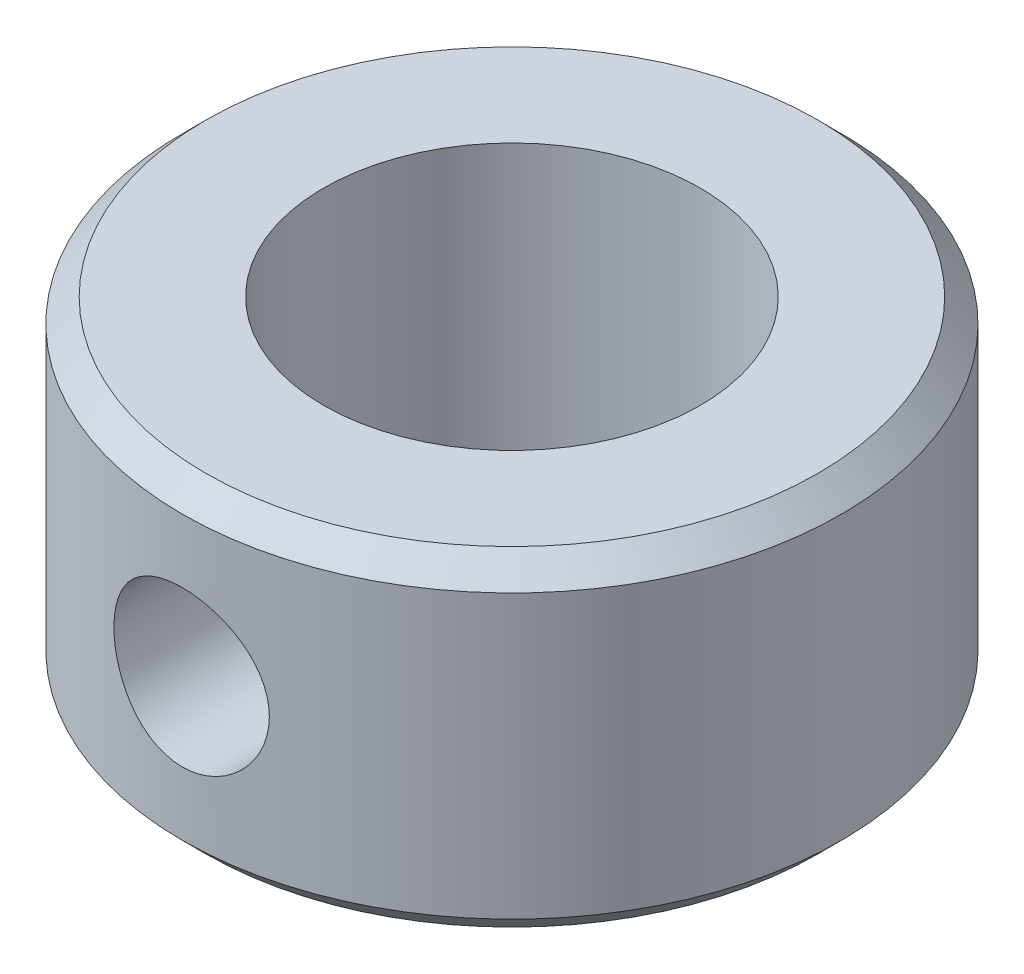
ISO-10303-21;
HEADER;
FILE_DESCRIPTION(('STEP AP214'),'2;1');
FILE_NAME('part.step','',(''),(''),'','','');
FILE_SCHEMA(('AUTOMOTIVE_DESIGN { 1 0 10303 214 1 1 1 1 }'));
ENDSEC;
DATA;
#1=APPLICATION_CONTEXT('core data for automotive mechanical design processes');
#2=APPLICATION_PROTOCOL_DEFINITION('international standard','automotive_design',2000,#1);
#3=PRODUCT_CONTEXT('',#1,'mechanical');
#4=PRODUCT('Part','Part','',(#3));
#5=PRODUCT_RELATED_PRODUCT_CATEGORY('part','',(#4));
#6=PRODUCT_DEFINITION_FORMATION('','',#4);
#7=PRODUCT_DEFINITION_CONTEXT('part definition',#1,'design');
#8=PRODUCT_DEFINITION('design','',#6,#7);
#9=PRODUCT_DEFINITION_SHAPE('','',#8);
#10=(LENGTH_UNIT() NAMED_UNIT(*) SI_UNIT(.MILLI.,.METRE.));
#11=(NAMED_UNIT(*) PLANE_ANGLE_UNIT() SI_UNIT($,.RADIAN.));
#12=(NAMED_UNIT(*) SI_UNIT($,.STERADIAN.) SOLID_ANGLE_UNIT());
#13=UNCERTAINTY_MEASURE_WITH_UNIT(LENGTH_MEASURE(1.E-05),#10,'distance_accuracy_value','');
#14=(GEOMETRIC_REPRESENTATION_CONTEXT(3) GLOBAL_UNCERTAINTY_ASSIGNED_CONTEXT((#13)) GLOBAL_UNIT_ASSIGNED_CONTEXT((#10,
#11,#12)) REPRESENTATION_CONTEXT('',''));
#15=CARTESIAN_POINT('',(0.,0.,0.));
#16=DIRECTION('',(0.,0.,1.));
#17=DIRECTION('',(1.,0.,0.));
#18=AXIS2_PLACEMENT_3D('',#15,#16,#17);
#19=CARTESIAN_POINT('',(0.,3.5,0.));
#20=DIRECTION('',(0.,1.,0.));
#21=DIRECTION('',(0.,0.,1.));
#22=AXIS2_PLACEMENT_3D('',#19,#20,#21);
#23=PLANE('',#22);
#24=CARTESIAN_POINT('',(0.,3.5,0.));
#25=DIRECTION('',(0.,1.,0.));
#26=DIRECTION('',(0.,0.,1.));
#27=AXIS2_PLACEMENT_3D('',#24,#25,#26);
#28=CIRCLE('',#27,6.5);
#29=CARTESIAN_POINT('',(0.,3.5,6.5));
#30=VERTEX_POINT('',#29);
#31=EDGE_CURVE('E10',#30,#30,#28,.T.);
#32=ORIENTED_EDGE('',*,*,#31,.T.);
#33=EDGE_LOOP('',(#32));
#34=FACE_BOUND('',#33,.T.);
#35=CARTESIAN_POINT('',(0.,3.5,0.));
#36=DIRECTION('',(0.,1.,0.));
#37=DIRECTION('',(0.,0.,1.));
#38=AXIS2_PLACEMENT_3D('',#35,#36,#37);
#39=CIRCLE('',#38,4.);
#40=CARTESIAN_POINT('',(0.,3.5,4.));
#41=VERTEX_POINT('',#40);
#42=EDGE_CURVE('E80',#41,#41,#39,.T.);
#43=ORIENTED_EDGE('',*,*,#42,.F.);
#44=EDGE_LOOP('',(#43));
#45=FACE_BOUND('',#44,.T.);
#46=ADVANCED_FACE('F53',(#34,#45),#23,.T.);
#47=CARTESIAN_POINT('',(0.,-3.5,0.));
#48=DIRECTION('',(0.,1.,0.));
#49=DIRECTION('',(0.,0.,1.));
#50=AXIS2_PLACEMENT_3D('',#47,#48,#49);
#51=PLANE('',#50);
#52=CARTESIAN_POINT('',(0.,-3.5,0.));
#53=DIRECTION('',(0.,1.,0.));
#54=DIRECTION('',(0.,0.,1.));
#55=AXIS2_PLACEMENT_3D('',#52,#53,#54);
#56=CIRCLE('',#55,6.5);
#57=CARTESIAN_POINT('',(0.,-3.5,6.5));
#58=VERTEX_POINT('',#57);
#59=EDGE_CURVE('E62',#58,#58,#56,.F.);
#60=ORIENTED_EDGE('',*,*,#59,.T.);
#61=EDGE_LOOP('',(#60));
#62=FACE_BOUND('',#61,.T.);
#63=CARTESIAN_POINT('',(0.,-3.5,0.));
#64=DIRECTION('',(0.,1.,0.));
#65=DIRECTION('',(0.,0.,1.));
#66=AXIS2_PLACEMENT_3D('',#63,#64,#65);
#67=CIRCLE('',#66,4.);
#68=CARTESIAN_POINT('',(0.,-3.5,4.));
#69=VERTEX_POINT('',#68);
#70=EDGE_CURVE('E81',#69,#69,#67,.T.);
#71=ORIENTED_EDGE('',*,*,#70,.T.);
#72=EDGE_LOOP('',(#71));
#73=FACE_BOUND('',#72,.T.);
#74=ADVANCED_FACE('F118',(#62,#73),#51,.F.);
#75=CARTESIAN_POINT('',(0.,3.5,0.));
#76=DIRECTION('',(0.,-1.,0.));
#77=DIRECTION('',(0.,0.,-1.));
#78=AXIS2_PLACEMENT_3D('',#75,#76,#77);
#79=CYLINDRICAL_SURFACE('',#78,7.);
#80=CARTESIAN_POINT('',(0.,-3.,0.));
#81=DIRECTION('',(0.,1.,0.));
#82=DIRECTION('',(0.,0.,1.));
#83=AXIS2_PLACEMENT_3D('',#80,#81,#82);
#84=CIRCLE('',#83,7.);
#85=CARTESIAN_POINT('',(0.,-3.,7.));
#86=VERTEX_POINT('',#85);
#87=EDGE_CURVE('E68',#86,#86,#84,.T.);
#88=ORIENTED_EDGE('',*,*,#87,.T.);
#89=EDGE_LOOP('',(#88));
#90=FACE_BOUND('',#89,.T.);
#91=CARTESIAN_POINT('',(0.,3.,0.));
#92=DIRECTION('',(0.,1.,0.));
#93=DIRECTION('',(0.,0.,1.));
#94=AXIS2_PLACEMENT_3D('',#91,#92,#93);
#95=CIRCLE('',#94,7.);
#96=CARTESIAN_POINT('',(0.,3.,7.));
#97=VERTEX_POINT('',#96);
#98=EDGE_CURVE('E74',#97,#97,#95,.F.);
#99=ORIENTED_EDGE('',*,*,#98,.T.);
#100=EDGE_LOOP('',(#99));
#101=FACE_BOUND('',#100,.T.);
#102=CARTESIAN_POINT('',(1.65,0.,6.80275679412398));
#103=CARTESIAN_POINT('',(1.64999713007316,-0.0912890000234778,6.80275861136205));
#104=CARTESIAN_POINT('',(1.64239813439995,-0.182610998381094,6.80461440498174));
#105=CARTESIAN_POINT('',(1.61224414767597,-0.362644563434028,6.81182064992733));
#106=CARTESIAN_POINT('',(1.58967946321205,-0.451354399288548,6.81717336620826));
#107=CARTESIAN_POINT('',(1.53035515036094,-0.623533512523368,6.83073431325551));
#108=CARTESIAN_POINT('',(1.49361254058449,-0.707008933959494,6.83893911932177));
#109=CARTESIAN_POINT('',(1.40702581854958,-0.866616532790047,6.85727558075245));
#110=CARTESIAN_POINT('',(1.3571815350499,-0.94274861418793,6.86740726130097));
#111=CARTESIAN_POINT('',(1.24476461908352,-1.08699982868594,6.88867782513987));
#112=CARTESIAN_POINT('',(1.18198309355868,-1.15495404527719,6.89983131541127));
#113=CARTESIAN_POINT('',(1.04592427298928,-1.27947171170116,6.92176152937784));
#114=CARTESIAN_POINT('',(0.972646078487497,-1.33603418437752,6.93253822068664));
#115=CARTESIAN_POINT('',(0.816555491676995,-1.43682696981727,6.95266103704034));
#116=CARTESIAN_POINT('',(0.733636814479665,-1.48089686123284,6.96198791366554));
#117=CARTESIAN_POINT('',(0.561312838562636,-1.55441290827776,6.97799434603916));
#118=CARTESIAN_POINT('',(0.471908389601373,-1.58386097569016,6.98467424785277));
#119=CARTESIAN_POINT('',(0.290868022052415,-1.62677370217112,6.99453084372035));
#120=CARTESIAN_POINT('',(0.199301775715461,-1.64051799396695,6.99776875317269));
#121=CARTESIAN_POINT('',(0.0151097839078784,-1.65250913676126,7.00058928212562));
#122=CARTESIAN_POINT('',(-0.0775158200378344,-1.65075803426303,7.00017238432294));
#123=CARTESIAN_POINT('',(-0.259263367840032,-1.63201259498984,6.99577641572093));
#124=CARTESIAN_POINT('',(-0.348418380319068,-1.61531988499546,6.99186783471482));
#125=CARTESIAN_POINT('',(-0.52262462498376,-1.56764792556427,6.98100889430398));
#126=CARTESIAN_POINT('',(-0.607675652983099,-1.53666796609913,6.97405838372646));
#127=CARTESIAN_POINT('',(-0.77207438679455,-1.46104622960672,6.95778608866946));
#128=CARTESIAN_POINT('',(-0.851369239725044,-1.41629382953033,6.94844521053821));
#129=CARTESIAN_POINT('',(-1.00143136070301,-1.31448077411501,6.92841069918987));
#130=CARTESIAN_POINT('',(-1.07219729215003,-1.25741819349895,6.91771685448099));
#131=CARTESIAN_POINT('',(-1.20498965605832,-1.13097547490599,6.89584251761335));
#132=CARTESIAN_POINT('',(-1.26676421005725,-1.06133150430551,6.88465650871199));
#133=CARTESIAN_POINT('',(-1.37780936391993,-0.912555678850199,6.8632971795881));
#134=CARTESIAN_POINT('',(-1.42707950447265,-0.833423475631591,6.85312389657327));
#135=CARTESIAN_POINT('',(-1.51185477157774,-0.667464740192947,6.83492437266263));
#136=CARTESIAN_POINT('',(-1.54730546989208,-0.580609406049148,6.82690665922475));
#137=CARTESIAN_POINT('',(-1.6030277151278,-0.401938722430842,6.8140390867396));
#138=CARTESIAN_POINT('',(-1.62330210645788,-0.310124305869232,6.80918863409247));
#139=CARTESIAN_POINT('',(-1.64769127898038,-0.126461443050763,6.80332774943589));
#140=CARTESIAN_POINT('',(-1.65217579860456,-0.0346648402699397,6.80222947433876));
#141=CARTESIAN_POINT('',(-1.64586488795024,0.148364576583739,6.80375919481422));
#142=CARTESIAN_POINT('',(-1.63507069283233,0.239597435631891,6.80638688917233));
#143=CARTESIAN_POINT('',(-1.59883140460811,0.417577450747466,6.81498886694796));
#144=CARTESIAN_POINT('',(-1.57359604251707,0.504369845653746,6.82091521063605));
#145=CARTESIAN_POINT('',(-1.50942069873872,0.672493686634512,6.83540229380027));
#146=CARTESIAN_POINT('',(-1.47047923644584,0.753824541593777,6.84396331787599));
#147=CARTESIAN_POINT('',(-1.37920410959564,0.91029905658938,6.86294389007106));
#148=CARTESIAN_POINT('',(-1.32664621508517,0.98530818474253,6.87339357272798));
#149=CARTESIAN_POINT('',(-1.20991829013253,1.12557800629822,6.89489755256543));
#150=CARTESIAN_POINT('',(-1.14574657256199,1.19083728083161,6.90595193742742));
#151=CARTESIAN_POINT('',(-1.00592681617982,1.31122298204255,6.92771364919943));
#152=CARTESIAN_POINT('',(-0.930057660220531,1.36609535547159,6.93840801965821));
#153=CARTESIAN_POINT('',(-0.769965220758949,1.4623180167779,6.95799159344945));
#154=CARTESIAN_POINT('',(-0.68574235635456,1.50366898256505,6.96688088727282));
#155=CARTESIAN_POINT('',(-0.511894272134561,1.57133783893331,6.98179887024889));
#156=CARTESIAN_POINT('',(-0.422310877248035,1.59775867456761,6.98784709878863));
#157=CARTESIAN_POINT('',(-0.239816201973852,1.63513286894146,6.99648655479454));
#158=CARTESIAN_POINT('',(-0.146905491020369,1.64608886147333,6.99907837091255));
#159=CARTESIAN_POINT('',(0.0372082467747346,1.65208813057133,7.00049202890772));
#160=CARTESIAN_POINT('',(0.128398504210685,1.64750832426096,6.9994031706394));
#161=CARTESIAN_POINT('',(0.308670729816515,1.62341975270527,6.99377268350157));
#162=CARTESIAN_POINT('',(0.397752748359328,1.60391134452658,6.98923113721447));
#163=CARTESIAN_POINT('',(0.57093357689564,1.55071176108928,6.97721604451341));
#164=CARTESIAN_POINT('',(0.655052149359144,1.51708187051132,6.96975517685192));
#165=CARTESIAN_POINT('',(0.816498795364758,1.4366509910792,6.95269208722048));
#166=CARTESIAN_POINT('',(0.893826099578996,1.38984851252764,6.94308962308136));
#167=CARTESIAN_POINT('',(1.04130725997212,1.28321390355334,6.92252474173611));
#168=CARTESIAN_POINT('',(1.11126948147334,1.22312153020512,6.91153737485731));
#169=CARTESIAN_POINT('',(1.24024523339421,1.09212760248887,6.88956325338245));
#170=CARTESIAN_POINT('',(1.29925605605595,1.02122338274089,6.87857649960749));
#171=CARTESIAN_POINT('',(1.40557849643651,0.869245406144734,6.85764827463158));
#172=CARTESIAN_POINT('',(1.45268661539722,0.788026388521305,6.84772646444862));
#173=CARTESIAN_POINT('',(1.53250931126199,0.61860266624687,6.83030721412674));
#174=CARTESIAN_POINT('',(1.56523518241758,0.530403507505558,6.82280787287529));
#175=CARTESIAN_POINT('',(1.61002842680637,0.36853084559052,6.81235745600281));
#176=CARTESIAN_POINT('',(1.62498700416516,0.295683995155683,6.80878274857867));
#177=CARTESIAN_POINT('',(1.64497362976398,0.148565318467719,6.8039817559383));
#178=CARTESIAN_POINT('',(1.65000233562816,0.0742935869089515,6.80275531520391));
#179=CARTESIAN_POINT('',(1.65,0.,6.80275679412398));
#180=B_SPLINE_CURVE_WITH_KNOTS('',3,(#102,#103,#104,#105,#106,#107,#108,#109,#110,#111,#112,
#113,#114,#115,#116,#117,#118,#119,#120,#121,#122,#123,#124,#125,#126,#127,#128,#129,#130,#131,
#132,#133,#134,#135,#136,#137,#138,#139,#140,#141,#142,#143,#144,#145,#146,#147,#148,#149,#150,
#151,#152,#153,#154,#155,#156,#157,#158,#159,#160,#161,#162,#163,#164,#165,#166,#167,#168,#169,
#170,#171,#172,#173,#174,#175,#176,#177,#178,#179),.UNSPECIFIED.,.T.,.F.,(4,2,2,2,2,2,2,2,2,2,2,
2,2,2,2,2,2,2,2,2,2,2,2,2,2,2,2,2,2,2,2,2,2,2,2,2,2,2,4),(0.,0.273594440399257,
0.547366263700773,0.820810479503744,1.0942582694491,1.37252656286893,1.65081871531698,
1.93253747960749,2.21421939985748,2.49080324523182,2.76735056224876,3.03843805884696,
3.30953902903524,3.5828770280852,3.85625780745004,4.13623055025586,4.41621357550839,
4.69728844125184,4.97831061353603,5.25270687968443,5.52708096437946,5.79756789407088,
6.06808405216623,6.34337456664896,6.61870510445458,6.90008328124663,7.18144734868653,
7.46084693391317,7.74019892930651,8.01282246332762,8.28543947686366,8.55688541369867,
8.82836206089266,9.10571835709369,9.38314313916058,9.66503130549495,9.9466977102697,
10.1693714016501,10.3920303455577),.UNSPECIFIED.);
#181=CARTESIAN_POINT('',(1.65,0.,6.80275679412398));
#182=VERTEX_POINT('',#181);
#183=EDGE_CURVE('E85',#182,#182,#180,.T.);
#184=ORIENTED_EDGE('',*,*,#183,.T.);
#185=EDGE_LOOP('',(#184));
#186=FACE_BOUND('',#185,.T.);
#187=ADVANCED_FACE('F102',(#90,#101,#186),#79,.T.);
#188=CARTESIAN_POINT('',(0.,3.5,0.));
#189=DIRECTION('',(0.,-1.,0.));
#190=DIRECTION('',(0.,0.,-1.));
#191=AXIS2_PLACEMENT_3D('',#188,#189,#190);
#192=CYLINDRICAL_SURFACE('',#191,4.);
#193=CARTESIAN_POINT('',(1.65,0.,3.64383040220041));
#194=CARTESIAN_POINT('',(1.64999056813102,-0.0880964802256835,3.64383945275153));
#195=CARTESIAN_POINT('',(1.64289989177358,-0.176340431973594,3.64707173267573));
#196=CARTESIAN_POINT('',(1.61480845546373,-0.35028706107888,3.65959209124688));
#197=CARTESIAN_POINT('',(1.5937695789634,-0.435982100597603,3.66889676295874));
#198=CARTESIAN_POINT('',(1.53873536249638,-0.602002938130633,3.69231325052126));
#199=CARTESIAN_POINT('',(1.50479212400174,-0.682348820218598,3.70640571161012));
#200=CARTESIAN_POINT('',(1.42506535594207,-0.836181766834224,3.73778230052357));
#201=CARTESIAN_POINT('',(1.37928479159595,-0.909670542784035,3.75506562873473));
#202=CARTESIAN_POINT('',(1.27419856290371,-1.0522286878465,3.7920553041855));
#203=CARTESIAN_POINT('',(1.2142851824136,-1.12082925578021,3.81184277704779));
#204=CARTESIAN_POINT('',(1.08391072165483,-1.24735477190876,3.85094363418238));
#205=CARTESIAN_POINT('',(1.01344563996364,-1.30527565147222,3.87025683535296));
#206=CARTESIAN_POINT('',(0.860301943593381,-1.41117137130186,3.90721575035942));
#207=CARTESIAN_POINT('',(0.77723239011359,-1.45862093270616,3.92475616703248));
#208=CARTESIAN_POINT('',(0.603436361875856,-1.5386701453217,3.95520283117798));
#209=CARTESIAN_POINT('',(0.512713242513044,-1.57127626434656,3.96811109652272));
#210=CARTESIAN_POINT('',(0.331105172304398,-1.61902070665623,3.98726403378776));
#211=CARTESIAN_POINT('',(0.240465625184492,-1.63496684792324,3.99381564337609));
#212=CARTESIAN_POINT('',(0.0575763551498645,-1.65154665185517,4.0006306156112));
#213=CARTESIAN_POINT('',(-0.0346727137709559,-1.65218639532201,4.00089647540932));
#214=CARTESIAN_POINT('',(-0.212297380895986,-1.63856350386341,3.99529224160632));
#215=CARTESIAN_POINT('',(-0.297754665400398,-1.6251878162829,3.98978733384658));
#216=CARTESIAN_POINT('',(-0.46508584523528,-1.58543118255224,3.97375926025944));
#217=CARTESIAN_POINT('',(-0.546959476205493,-1.55904927870932,3.96323572489496));
#218=CARTESIAN_POINT('',(-0.70629560681723,-1.49371233827982,3.93798907731603));
#219=CARTESIAN_POINT('',(-0.78367197976247,-1.45457201007513,3.92320447216362));
#220=CARTESIAN_POINT('',(-0.930960489992467,-1.3650087208134,3.89088763760773));
#221=CARTESIAN_POINT('',(-1.00086999453932,-1.3145817994967,3.87335444442336));
#222=CARTESIAN_POINT('',(-1.13638530947041,-1.19981176097137,3.83587133640027));
#223=CARTESIAN_POINT('',(-1.20135746318645,-1.13474658910128,3.8158381454309));
#224=CARTESIAN_POINT('',(-1.31973838423493,-0.994590333678427,3.77653142784555));
#225=CARTESIAN_POINT('',(-1.37314286572202,-0.9194955507367,3.75725818494773));
#226=CARTESIAN_POINT('',(-1.46845339844828,-0.758401596452686,3.72106607156909));
#227=CARTESIAN_POINT('',(-1.50994179309277,-0.672132428307351,3.70424107982558));
#228=CARTESIAN_POINT('',(-1.57754508127096,-0.492953328594106,3.67596385006485));
#229=CARTESIAN_POINT('',(-1.60367071206121,-0.400048086126186,3.66450786071417));
#230=CARTESIAN_POINT('',(-1.63821320355942,-0.216577104815016,3.64919091711418));
#231=CARTESIAN_POINT('',(-1.64765569454682,-0.126241698817142,3.64489111171831));
#232=CARTESIAN_POINT('',(-1.65157101672826,0.0548056296985968,3.64311980380967));
#233=CARTESIAN_POINT('',(-1.64604885780402,0.145517416059282,3.64564601607449));
#234=CARTESIAN_POINT('',(-1.62112710501826,0.318801009049471,3.65678944366161));
#235=CARTESIAN_POINT('',(-1.60261202118543,0.401528179674607,3.66501803861664));
#236=CARTESIAN_POINT('',(-1.55339580262015,0.562637064379971,3.68614612916707));
#237=CARTESIAN_POINT('',(-1.52269185697123,0.641017771351658,3.69904670212356));
#238=CARTESIAN_POINT('',(-1.44853902204985,0.794879005695637,3.72872477858182));
#239=CARTESIAN_POINT('',(-1.40460979308264,0.870100194779245,3.74564214050945));
#240=CARTESIAN_POINT('',(-1.30573455409451,1.01246016942973,3.78124523189864));
#241=CARTESIAN_POINT('',(-1.25078384473683,1.07959548773512,3.79993171387674));
#242=CARTESIAN_POINT('',(-1.12627542162099,1.20942962644671,3.83876011670653));
#243=CARTESIAN_POINT('',(-1.05590387126704,1.27135173704872,3.85889967217623));
#244=CARTESIAN_POINT('',(-0.905297980080104,1.38264285566206,3.89698114804694));
#245=CARTESIAN_POINT('',(-0.825063002026905,1.4320110520032,3.91492292631236));
#246=CARTESIAN_POINT('',(-0.656516816883268,1.51670413420679,3.94668767391886));
#247=CARTESIAN_POINT('',(-0.568191273870492,1.55200347500273,3.96050313975064));
#248=CARTESIAN_POINT('',(-0.386140833605178,1.60699165685875,3.98237104121021));
#249=CARTESIAN_POINT('',(-0.292419112817561,1.62668958293894,3.9904268305481));
#250=CARTESIAN_POINT('',(-0.109187189544837,1.64878822892048,3.9994889299446));
#251=CARTESIAN_POINT('',(-0.0198303081186367,1.65228482874194,4.00094173424749));
#252=CARTESIAN_POINT('',(0.15816173919541,1.64481456562972,3.99786220239438));
#253=CARTESIAN_POINT('',(0.246797024648479,1.63385015000455,3.99333087896147));
#254=CARTESIAN_POINT('',(0.417705375935875,1.59855535786444,3.979024148364));
#255=CARTESIAN_POINT('',(0.50009237162785,1.57469555788545,3.96943363922013));
#256=CARTESIAN_POINT('',(0.659667355734159,1.51479588512001,3.94605480923816));
#257=CARTESIAN_POINT('',(0.736854343148743,1.47875367521332,3.93226568297163));
#258=CARTESIAN_POINT('',(0.887661133732618,1.39369547331361,3.90105808483759));
#259=CARTESIAN_POINT('',(0.960964214361149,1.34416874322707,3.88350423911689));
#260=CARTESIAN_POINT('',(1.09852932170704,1.23429715321,3.84685709666619));
#261=CARTESIAN_POINT('',(1.1627880603165,1.17394837691919,3.82776324400832));
#262=CARTESIAN_POINT('',(1.28487769945047,1.03941247264534,3.78859741195738));
#263=CARTESIAN_POINT('',(1.34199767947157,0.964572243115062,3.76854475207571));
#264=CARTESIAN_POINT('',(1.4429647467733,0.805734024318934,3.73105419200534));
#265=CARTESIAN_POINT('',(1.48680449811903,0.721731008290411,3.7136177396712));
#266=CARTESIAN_POINT('',(1.55944447766651,0.547271558730105,3.68370387904713));
#267=CARTESIAN_POINT('',(1.58834112875234,0.456860891908903,3.67119480418034));
#268=CARTESIAN_POINT('',(1.63017263567573,0.271952855921641,3.65281837075147));
#269=CARTESIAN_POINT('',(1.64316103312974,0.177470309123129,3.64692873900432));
#270=CARTESIAN_POINT('',(1.6493120932942,0.0551366863573554,3.64414054419779));
#271=CARTESIAN_POINT('',(1.6500029523216,0.0275755677149822,3.64382756923723));
#272=CARTESIAN_POINT('',(1.65,0.,3.64383040220041));
#273=B_SPLINE_CURVE_WITH_KNOTS('',3,(#193,#194,#195,#196,#197,#198,#199,#200,#201,#202,#203,
#204,#205,#206,#207,#208,#209,#210,#211,#212,#213,#214,#215,#216,#217,#218,#219,#220,#221,#222,
#223,#224,#225,#226,#227,#228,#229,#230,#231,#232,#233,#234,#235,#236,#237,#238,#239,#240,#241,
#242,#243,#244,#245,#246,#247,#248,#249,#250,#251,#252,#253,#254,#255,#256,#257,#258,#259,#260,
#261,#262,#263,#264,#265,#266,#267,#268,#269,#270,#271,#272),.UNSPECIFIED.,.T.,.F.,(4,2,2,2,2,2,
2,2,2,2,2,2,2,2,2,2,2,2,2,2,2,2,2,2,2,2,2,2,2,2,2,2,2,2,2,2,2,2,2,4),(0.,0.264211724660744,
0.529148459018597,0.793026677872048,1.05683885985756,1.33523297260792,1.61373292676209,
1.90403076094908,2.19420198072699,2.4695381624427,2.74476495901024,3.00356896819766,
3.26239203686791,3.5251552692474,3.78801084539545,4.06907613148064,4.35024537535724,
4.64031806272423,4.9301877724111,5.20152035698263,5.47276211576042,5.72713321026166,
5.9815630002888,6.24665916965708,6.51186861189123,6.79815687284346,7.08446363898863,
7.3712879145617,7.6579450434915,7.92489841526079,8.19180661499934,8.44957452423759,
8.70739191275387,8.97680852354694,9.24632283025306,9.53374725602174,9.82133016535515,
10.1070334851925,10.3917725616094,10.4744749384332),.UNSPECIFIED.);
#274=CARTESIAN_POINT('',(1.65,0.,3.64383040220041));
#275=VERTEX_POINT('',#274);
#276=EDGE_CURVE('E97',#275,#275,#273,.T.);
#277=ORIENTED_EDGE('',*,*,#276,.F.);
#278=EDGE_LOOP('',(#277));
#279=FACE_BOUND('',#278,.T.);
#280=ORIENTED_EDGE('',*,*,#42,.T.);
#281=EDGE_LOOP('',(#280));
#282=FACE_BOUND('',#281,.T.);
#283=ORIENTED_EDGE('',*,*,#70,.F.);
#284=EDGE_LOOP('',(#283));
#285=FACE_BOUND('',#284,.T.);
#286=ADVANCED_FACE('F109',(#279,#282,#285),#192,.F.);
#287=CARTESIAN_POINT('',(0.,0.,7.));
#288=DIRECTION('',(0.,0.,1.));
#289=DIRECTION('',(1.,0.,0.));
#290=AXIS2_PLACEMENT_3D('',#287,#288,#289);
#291=CYLINDRICAL_SURFACE('',#290,1.65);
#292=ORIENTED_EDGE('',*,*,#276,.T.);
#293=EDGE_LOOP('',(#292));
#294=FACE_BOUND('',#293,.T.);
#295=ORIENTED_EDGE('',*,*,#183,.F.);
#296=EDGE_LOOP('',(#295));
#297=FACE_BOUND('',#296,.T.);
#298=ADVANCED_FACE('F105',(#294,#297),#291,.F.);
#299=CARTESIAN_POINT('',(0.,-3.,0.));
#300=DIRECTION('',(0.,1.,0.));
#301=DIRECTION('',(0.,0.,1.));
#302=AXIS2_PLACEMENT_3D('',#299,#300,#301);
#303=CONICAL_SURFACE('',#302,7.,0.785398163397452);
#304=ORIENTED_EDGE('',*,*,#59,.F.);
#305=EDGE_LOOP('',(#304));
#306=FACE_BOUND('',#305,.T.);
#307=ORIENTED_EDGE('',*,*,#87,.F.);
#308=EDGE_LOOP('',(#307));
#309=FACE_BOUND('',#308,.T.);
#310=ADVANCED_FACE('F108',(#306,#309),#303,.T.);
#311=CARTESIAN_POINT('',(0.,3.5,0.));
#312=DIRECTION('',(0.,-1.,0.));
#313=DIRECTION('',(0.,0.,-1.));
#314=AXIS2_PLACEMENT_3D('',#311,#312,#313);
#315=CONICAL_SURFACE('',#314,6.5,0.785398163397445);
#316=ORIENTED_EDGE('',*,*,#98,.F.);
#317=EDGE_LOOP('',(#316));
#318=FACE_BOUND('',#317,.T.);
#319=ORIENTED_EDGE('',*,*,#31,.F.);
#320=EDGE_LOOP('',(#319));
#321=FACE_BOUND('',#320,.T.);
#322=ADVANCED_FACE('F56',(#318,#321),#315,.T.);
#323=CLOSED_SHELL('',(#46,#74,#187,#286,#298,#310,#322));
#324=MANIFOLD_SOLID_BREP('B2',#323);
#325=ADVANCED_BREP_SHAPE_REPRESENTATION('',(#18,#324),#14);
#326=SHAPE_DEFINITION_REPRESENTATION(#9,#325);
ENDSEC;
END-ISO-10303-21;
